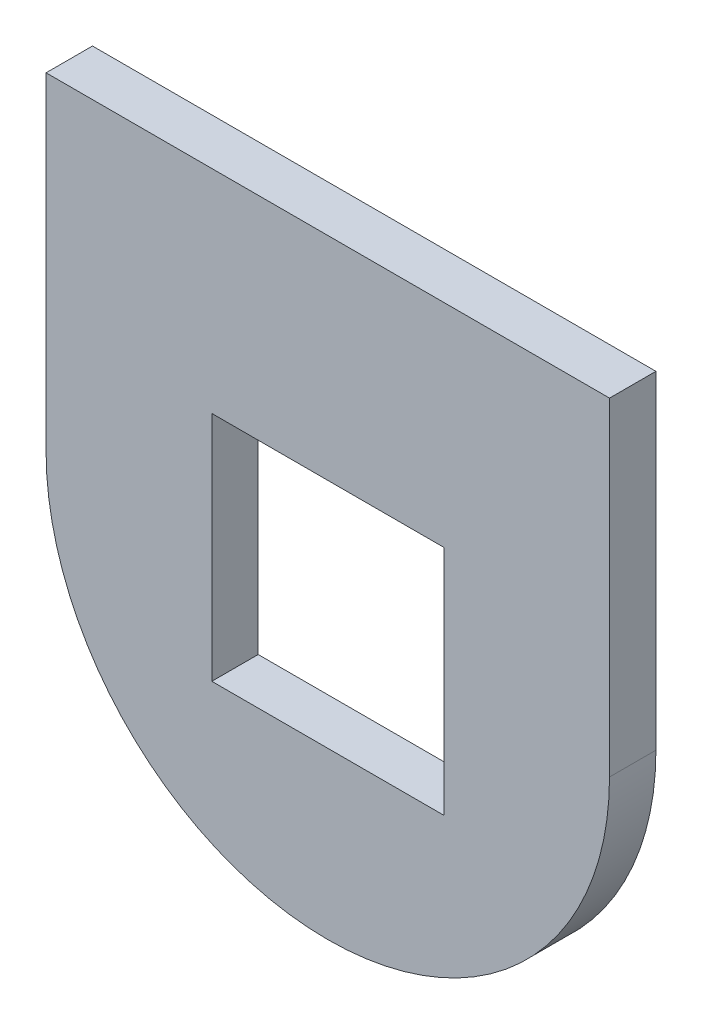
ISO-10303-21;
HEADER;
FILE_DESCRIPTION(('STEP AP214'),'2;1');
FILE_NAME('part.step','',(''),(''),'','','');
FILE_SCHEMA(('AUTOMOTIVE_DESIGN { 1 0 10303 214 1 1 1 1 }'));
ENDSEC;
DATA;
#1=APPLICATION_CONTEXT('core data for automotive mechanical design processes');
#2=APPLICATION_PROTOCOL_DEFINITION('international standard','automotive_design',2000,#1);
#3=PRODUCT_CONTEXT('',#1,'mechanical');
#4=PRODUCT('Part','Part','',(#3));
#5=PRODUCT_RELATED_PRODUCT_CATEGORY('part','',(#4));
#6=PRODUCT_DEFINITION_FORMATION('','',#4);
#7=PRODUCT_DEFINITION_CONTEXT('part definition',#1,'design');
#8=PRODUCT_DEFINITION('design','',#6,#7);
#9=PRODUCT_DEFINITION_SHAPE('','',#8);
#10=(LENGTH_UNIT() NAMED_UNIT(*) SI_UNIT(.MILLI.,.METRE.));
#11=(NAMED_UNIT(*) PLANE_ANGLE_UNIT() SI_UNIT($,.RADIAN.));
#12=(NAMED_UNIT(*) SI_UNIT($,.STERADIAN.) SOLID_ANGLE_UNIT());
#13=UNCERTAINTY_MEASURE_WITH_UNIT(LENGTH_MEASURE(1.E-05),#10,'distance_accuracy_value','');
#14=(GEOMETRIC_REPRESENTATION_CONTEXT(3) GLOBAL_UNCERTAINTY_ASSIGNED_CONTEXT((#13)) GLOBAL_UNIT_ASSIGNED_CONTEXT((#10,
#11,#12)) REPRESENTATION_CONTEXT('',''));
#15=CARTESIAN_POINT('',(0.,0.,0.));
#16=DIRECTION('',(0.,0.,1.));
#17=DIRECTION('',(1.,0.,0.));
#18=AXIS2_PLACEMENT_3D('',#15,#16,#17);
#19=CARTESIAN_POINT('',(85.,0.,7.));
#20=DIRECTION('',(-1.,0.,0.));
#21=DIRECTION('',(0.,0.,1.));
#22=AXIS2_PLACEMENT_3D('',#19,#20,#21);
#23=PLANE('',#22);
#24=DIRECTION('',(0.,1.,0.));
#25=VECTOR('',#24,1.);
#26=CARTESIAN_POINT('',(85.,0.,0.));
#27=LINE('',#26,#25);
#28=CARTESIAN_POINT('',(85.,45.,0.));
#29=VERTEX_POINT('',#28);
#30=CARTESIAN_POINT('',(85.,94.5,0.));
#31=VERTEX_POINT('',#30);
#32=EDGE_CURVE('E47',#29,#31,#27,.T.);
#33=ORIENTED_EDGE('',*,*,#32,.T.);
#34=DIRECTION('',(0.,0.,-1.));
#35=VECTOR('',#34,1.);
#36=CARTESIAN_POINT('',(85.,94.5,7.));
#37=LINE('',#36,#35);
#38=CARTESIAN_POINT('',(85.,94.5,7.));
#39=VERTEX_POINT('',#38);
#40=EDGE_CURVE('E61',#39,#31,#37,.T.);
#41=ORIENTED_EDGE('',*,*,#40,.F.);
#42=DIRECTION('',(0.,1.,0.));
#43=VECTOR('',#42,1.);
#44=CARTESIAN_POINT('',(85.,0.,7.));
#45=LINE('',#44,#43);
#46=CARTESIAN_POINT('',(85.,45.,7.));
#47=VERTEX_POINT('',#46);
#48=EDGE_CURVE('E11',#47,#39,#45,.T.);
#49=ORIENTED_EDGE('',*,*,#48,.F.);
#50=DIRECTION('',(0.,0.,-1.));
#51=VECTOR('',#50,1.);
#52=CARTESIAN_POINT('',(85.,45.,10.));
#53=LINE('',#52,#51);
#54=EDGE_CURVE('E192',#47,#29,#53,.T.);
#55=ORIENTED_EDGE('',*,*,#54,.T.);
#56=EDGE_LOOP('',(#33,#41,#49,#55));
#57=FACE_BOUND('',#56,.T.);
#58=ADVANCED_FACE('F43',(#57),#23,.F.);
#59=CARTESIAN_POINT('',(0.,0.,7.));
#60=DIRECTION('',(1.,0.,0.));
#61=DIRECTION('',(0.,0.,-1.));
#62=AXIS2_PLACEMENT_3D('',#59,#60,#61);
#63=PLANE('',#62);
#64=DIRECTION('',(0.,-1.,0.));
#65=VECTOR('',#64,1.);
#66=CARTESIAN_POINT('',(0.,0.,7.));
#67=LINE('',#66,#65);
#68=CARTESIAN_POINT('',(0.,94.5,7.));
#69=VERTEX_POINT('',#68);
#70=CARTESIAN_POINT('',(0.,45.,7.));
#71=VERTEX_POINT('',#70);
#72=EDGE_CURVE('E53',#69,#71,#67,.T.);
#73=ORIENTED_EDGE('',*,*,#72,.F.);
#74=DIRECTION('',(0.,0.,1.));
#75=VECTOR('',#74,1.);
#76=CARTESIAN_POINT('',(0.,94.5,7.));
#77=LINE('',#76,#75);
#78=CARTESIAN_POINT('',(0.,94.5,0.));
#79=VERTEX_POINT('',#78);
#80=EDGE_CURVE('E110',#79,#69,#77,.T.);
#81=ORIENTED_EDGE('',*,*,#80,.F.);
#82=DIRECTION('',(0.,-1.,0.));
#83=VECTOR('',#82,1.);
#84=CARTESIAN_POINT('',(0.,0.,0.));
#85=LINE('',#84,#83);
#86=CARTESIAN_POINT('',(0.,45.,0.));
#87=VERTEX_POINT('',#86);
#88=EDGE_CURVE('E69',#79,#87,#85,.T.);
#89=ORIENTED_EDGE('',*,*,#88,.T.);
#90=DIRECTION('',(0.,0.,-1.));
#91=VECTOR('',#90,1.);
#92=CARTESIAN_POINT('',(0.,45.,10.));
#93=LINE('',#92,#91);
#94=EDGE_CURVE('E125',#71,#87,#93,.T.);
#95=ORIENTED_EDGE('',*,*,#94,.F.);
#96=EDGE_LOOP('',(#73,#81,#89,#95));
#97=FACE_BOUND('',#96,.T.);
#98=ADVANCED_FACE('F45',(#97),#63,.F.);
#99=CARTESIAN_POINT('',(0.,0.,7.));
#100=DIRECTION('',(0.,0.,-1.));
#101=DIRECTION('',(-1.,0.,0.));
#102=AXIS2_PLACEMENT_3D('',#99,#100,#101);
#103=PLANE('',#102);
#104=DIRECTION('',(-1.,0.,0.));
#105=VECTOR('',#104,1.);
#106=CARTESIAN_POINT('',(25.,62.5,7.));
#107=LINE('',#106,#105);
#108=CARTESIAN_POINT('',(60.,62.5,7.));
#109=VERTEX_POINT('',#108);
#110=CARTESIAN_POINT('',(25.,62.5,7.));
#111=VERTEX_POINT('',#110);
#112=EDGE_CURVE('E174',#109,#111,#107,.T.);
#113=ORIENTED_EDGE('',*,*,#112,.F.);
#114=DIRECTION('',(0.,1.,0.));
#115=VECTOR('',#114,1.);
#116=CARTESIAN_POINT('',(60.,27.5,7.));
#117=LINE('',#116,#115);
#118=CARTESIAN_POINT('',(60.,27.5,7.));
#119=VERTEX_POINT('',#118);
#120=EDGE_CURVE('E171',#119,#109,#117,.T.);
#121=ORIENTED_EDGE('',*,*,#120,.F.);
#122=DIRECTION('',(1.,0.,0.));
#123=VECTOR('',#122,1.);
#124=CARTESIAN_POINT('',(25.,27.5,7.));
#125=LINE('',#124,#123);
#126=CARTESIAN_POINT('',(25.,27.5,7.));
#127=VERTEX_POINT('',#126);
#128=EDGE_CURVE('E145',#127,#119,#125,.T.);
#129=ORIENTED_EDGE('',*,*,#128,.F.);
#130=DIRECTION('',(0.,-1.,0.));
#131=VECTOR('',#130,1.);
#132=CARTESIAN_POINT('',(25.,27.5,7.));
#133=LINE('',#132,#131);
#134=EDGE_CURVE('E177',#111,#127,#133,.T.);
#135=ORIENTED_EDGE('',*,*,#134,.F.);
#136=EDGE_LOOP('',(#113,#121,#129,#135));
#137=FACE_BOUND('',#136,.T.);
#138=ORIENTED_EDGE('',*,*,#48,.T.);
#139=DIRECTION('',(1.,0.,0.));
#140=VECTOR('',#139,1.);
#141=CARTESIAN_POINT('',(0.,94.5,7.));
#142=LINE('',#141,#140);
#143=EDGE_CURVE('E113',#69,#39,#142,.T.);
#144=ORIENTED_EDGE('',*,*,#143,.F.);
#145=ORIENTED_EDGE('',*,*,#72,.T.);
#146=CARTESIAN_POINT('',(42.5,45.,7.));
#147=DIRECTION('',(0.,0.,-1.));
#148=DIRECTION('',(-1.,0.,0.));
#149=AXIS2_PLACEMENT_3D('',#146,#147,#148);
#150=CIRCLE('',#149,42.5);
#151=EDGE_CURVE('E175',#71,#47,#150,.F.);
#152=ORIENTED_EDGE('',*,*,#151,.T.);
#153=EDGE_LOOP('',(#138,#144,#145,#152));
#154=FACE_BOUND('',#153,.T.);
#155=ADVANCED_FACE('F119',(#137,#154),#103,.F.);
#156=CARTESIAN_POINT('',(0.,0.,0.));
#157=DIRECTION('',(0.,0.,-1.));
#158=DIRECTION('',(-1.,0.,0.));
#159=AXIS2_PLACEMENT_3D('',#156,#157,#158);
#160=PLANE('',#159);
#161=DIRECTION('',(-1.,0.,0.));
#162=VECTOR('',#161,1.);
#163=CARTESIAN_POINT('',(0.,94.5,0.));
#164=LINE('',#163,#162);
#165=EDGE_CURVE('E114',#31,#79,#164,.T.);
#166=ORIENTED_EDGE('',*,*,#165,.F.);
#167=ORIENTED_EDGE('',*,*,#32,.F.);
#168=CARTESIAN_POINT('',(42.5,45.,0.));
#169=DIRECTION('',(0.,0.,1.));
#170=DIRECTION('',(-1.,0.,0.));
#171=AXIS2_PLACEMENT_3D('',#168,#169,#170);
#172=CIRCLE('',#171,42.5);
#173=EDGE_CURVE('E196',#87,#29,#172,.T.);
#174=ORIENTED_EDGE('',*,*,#173,.F.);
#175=ORIENTED_EDGE('',*,*,#88,.F.);
#176=EDGE_LOOP('',(#166,#167,#174,#175));
#177=FACE_BOUND('',#176,.T.);
#178=DIRECTION('',(0.,1.,0.));
#179=VECTOR('',#178,1.);
#180=CARTESIAN_POINT('',(60.,27.5,0.));
#181=LINE('',#180,#179);
#182=CARTESIAN_POINT('',(60.,27.5,0.));
#183=VERTEX_POINT('',#182);
#184=CARTESIAN_POINT('',(60.,62.5,0.));
#185=VERTEX_POINT('',#184);
#186=EDGE_CURVE('E182',#183,#185,#181,.T.);
#187=ORIENTED_EDGE('',*,*,#186,.T.);
#188=DIRECTION('',(-1.,0.,0.));
#189=VECTOR('',#188,1.);
#190=CARTESIAN_POINT('',(25.,62.5,0.));
#191=LINE('',#190,#189);
#192=CARTESIAN_POINT('',(25.,62.5,0.));
#193=VERTEX_POINT('',#192);
#194=EDGE_CURVE('E167',#185,#193,#191,.T.);
#195=ORIENTED_EDGE('',*,*,#194,.T.);
#196=DIRECTION('',(0.,-1.,0.));
#197=VECTOR('',#196,1.);
#198=CARTESIAN_POINT('',(25.,27.5,0.));
#199=LINE('',#198,#197);
#200=CARTESIAN_POINT('',(25.,27.5,0.));
#201=VERTEX_POINT('',#200);
#202=EDGE_CURVE('E160',#193,#201,#199,.T.);
#203=ORIENTED_EDGE('',*,*,#202,.T.);
#204=DIRECTION('',(1.,0.,0.));
#205=VECTOR('',#204,1.);
#206=CARTESIAN_POINT('',(25.,27.5,0.));
#207=LINE('',#206,#205);
#208=EDGE_CURVE('E154',#201,#183,#207,.T.);
#209=ORIENTED_EDGE('',*,*,#208,.T.);
#210=EDGE_LOOP('',(#187,#195,#203,#209));
#211=FACE_BOUND('',#210,.T.);
#212=ADVANCED_FACE('F210',(#177,#211),#160,.T.);
#213=CARTESIAN_POINT('',(60.,27.5,0.));
#214=DIRECTION('',(1.,0.,0.));
#215=DIRECTION('',(0.,0.,-1.));
#216=AXIS2_PLACEMENT_3D('',#213,#214,#215);
#217=PLANE('',#216);
#218=ORIENTED_EDGE('',*,*,#120,.T.);
#219=DIRECTION('',(0.,0.,1.));
#220=VECTOR('',#219,1.);
#221=CARTESIAN_POINT('',(60.,62.5,0.));
#222=LINE('',#221,#220);
#223=EDGE_CURVE('E131',#185,#109,#222,.T.);
#224=ORIENTED_EDGE('',*,*,#223,.F.);
#225=ORIENTED_EDGE('',*,*,#186,.F.);
#226=DIRECTION('',(0.,0.,1.));
#227=VECTOR('',#226,1.);
#228=CARTESIAN_POINT('',(60.,27.5,0.));
#229=LINE('',#228,#227);
#230=EDGE_CURVE('E134',#183,#119,#229,.T.);
#231=ORIENTED_EDGE('',*,*,#230,.T.);
#232=EDGE_LOOP('',(#218,#224,#225,#231));
#233=FACE_BOUND('',#232,.T.);
#234=ADVANCED_FACE('F212',(#233),#217,.F.);
#235=CARTESIAN_POINT('',(25.,27.5,0.));
#236=DIRECTION('',(0.,-1.,0.));
#237=DIRECTION('',(0.,0.,-1.));
#238=AXIS2_PLACEMENT_3D('',#235,#236,#237);
#239=PLANE('',#238);
#240=ORIENTED_EDGE('',*,*,#128,.T.);
#241=ORIENTED_EDGE('',*,*,#230,.F.);
#242=ORIENTED_EDGE('',*,*,#208,.F.);
#243=DIRECTION('',(0.,0.,1.));
#244=VECTOR('',#243,1.);
#245=CARTESIAN_POINT('',(25.,27.5,0.));
#246=LINE('',#245,#244);
#247=EDGE_CURVE('E136',#201,#127,#246,.T.);
#248=ORIENTED_EDGE('',*,*,#247,.T.);
#249=EDGE_LOOP('',(#240,#241,#242,#248));
#250=FACE_BOUND('',#249,.T.);
#251=ADVANCED_FACE('F218',(#250),#239,.F.);
#252=CARTESIAN_POINT('',(25.,27.5,0.));
#253=DIRECTION('',(-1.,0.,0.));
#254=DIRECTION('',(0.,0.,1.));
#255=AXIS2_PLACEMENT_3D('',#252,#253,#254);
#256=PLANE('',#255);
#257=ORIENTED_EDGE('',*,*,#134,.T.);
#258=ORIENTED_EDGE('',*,*,#247,.F.);
#259=ORIENTED_EDGE('',*,*,#202,.F.);
#260=DIRECTION('',(0.,0.,1.));
#261=VECTOR('',#260,1.);
#262=CARTESIAN_POINT('',(25.,62.5,0.));
#263=LINE('',#262,#261);
#264=EDGE_CURVE('E142',#193,#111,#263,.T.);
#265=ORIENTED_EDGE('',*,*,#264,.T.);
#266=EDGE_LOOP('',(#257,#258,#259,#265));
#267=FACE_BOUND('',#266,.T.);
#268=ADVANCED_FACE('F263',(#267),#256,.F.);
#269=CARTESIAN_POINT('',(25.,62.5,0.));
#270=DIRECTION('',(0.,1.,0.));
#271=DIRECTION('',(0.,0.,1.));
#272=AXIS2_PLACEMENT_3D('',#269,#270,#271);
#273=PLANE('',#272);
#274=ORIENTED_EDGE('',*,*,#112,.T.);
#275=ORIENTED_EDGE('',*,*,#264,.F.);
#276=ORIENTED_EDGE('',*,*,#194,.F.);
#277=ORIENTED_EDGE('',*,*,#223,.T.);
#278=EDGE_LOOP('',(#274,#275,#276,#277));
#279=FACE_BOUND('',#278,.T.);
#280=ADVANCED_FACE('F257',(#279),#273,.F.);
#281=CARTESIAN_POINT('',(42.5,45.,10.));
#282=DIRECTION('',(0.,0.,-1.));
#283=DIRECTION('',(-1.,0.,0.));
#284=AXIS2_PLACEMENT_3D('',#281,#282,#283);
#285=CYLINDRICAL_SURFACE('',#284,42.5);
#286=ORIENTED_EDGE('',*,*,#94,.T.);
#287=ORIENTED_EDGE('',*,*,#173,.T.);
#288=ORIENTED_EDGE('',*,*,#54,.F.);
#289=ORIENTED_EDGE('',*,*,#151,.F.);
#290=EDGE_LOOP('',(#286,#287,#288,#289));
#291=FACE_BOUND('',#290,.T.);
#292=ADVANCED_FACE('F206',(#291),#285,.T.);
#293=CARTESIAN_POINT('',(0.,94.5,0.));
#294=DIRECTION('',(0.,-1.,0.));
#295=DIRECTION('',(0.,0.,-1.));
#296=AXIS2_PLACEMENT_3D('',#293,#294,#295);
#297=PLANE('',#296);
#298=ORIENTED_EDGE('',*,*,#80,.T.);
#299=ORIENTED_EDGE('',*,*,#143,.T.);
#300=ORIENTED_EDGE('',*,*,#40,.T.);
#301=ORIENTED_EDGE('',*,*,#165,.T.);
#302=EDGE_LOOP('',(#298,#299,#300,#301));
#303=FACE_BOUND('',#302,.T.);
#304=ADVANCED_FACE('F112',(#303),#297,.F.);
#305=CLOSED_SHELL('',(#58,#98,#155,#212,#234,#251,#268,#280,#292,#304));
#306=MANIFOLD_SOLID_BREP('B2',#305);
#307=ADVANCED_BREP_SHAPE_REPRESENTATION('',(#18,#306),#14);
#308=SHAPE_DEFINITION_REPRESENTATION(#9,#307);
ENDSEC;
END-ISO-10303-21;
